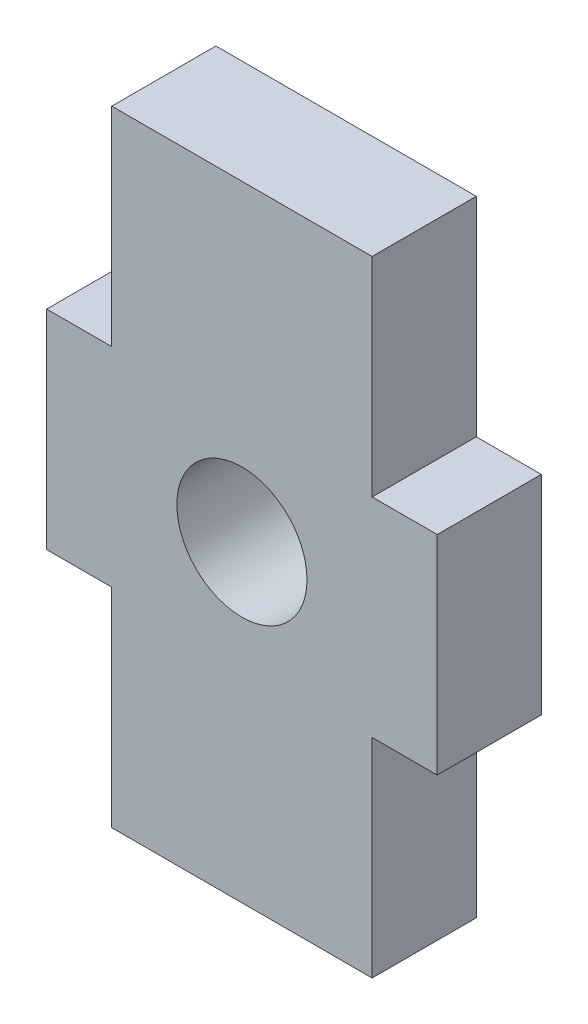
ISO-10303-21;
HEADER;
FILE_DESCRIPTION(('STEP AP214'),'2;1');
FILE_NAME('part.step','',(''),(''),'','','');
FILE_SCHEMA(('AUTOMOTIVE_DESIGN { 1 0 10303 214 1 1 1 1 }'));
ENDSEC;
DATA;
#1=APPLICATION_CONTEXT('core data for automotive mechanical design processes');
#2=APPLICATION_PROTOCOL_DEFINITION('international standard','automotive_design',2000,#1);
#3=PRODUCT_CONTEXT('',#1,'mechanical');
#4=PRODUCT('Part','Part','',(#3));
#5=PRODUCT_RELATED_PRODUCT_CATEGORY('part','',(#4));
#6=PRODUCT_DEFINITION_FORMATION('','',#4);
#7=PRODUCT_DEFINITION_CONTEXT('part definition',#1,'design');
#8=PRODUCT_DEFINITION('design','',#6,#7);
#9=PRODUCT_DEFINITION_SHAPE('','',#8);
#10=(LENGTH_UNIT() NAMED_UNIT(*) SI_UNIT(.MILLI.,.METRE.));
#11=(NAMED_UNIT(*) PLANE_ANGLE_UNIT() SI_UNIT($,.RADIAN.));
#12=(NAMED_UNIT(*) SI_UNIT($,.STERADIAN.) SOLID_ANGLE_UNIT());
#13=UNCERTAINTY_MEASURE_WITH_UNIT(LENGTH_MEASURE(1.E-05),#10,'distance_accuracy_value','');
#14=(GEOMETRIC_REPRESENTATION_CONTEXT(3) GLOBAL_UNCERTAINTY_ASSIGNED_CONTEXT((#13)) GLOBAL_UNIT_ASSIGNED_CONTEXT((#10,
#11,#12)) REPRESENTATION_CONTEXT('',''));
#15=CARTESIAN_POINT('',(0.,0.,0.));
#16=DIRECTION('',(0.,0.,1.));
#17=DIRECTION('',(1.,0.,0.));
#18=AXIS2_PLACEMENT_3D('',#15,#16,#17);
#19=CARTESIAN_POINT('',(0.,0.,2.));
#20=DIRECTION('',(0.,0.,-1.));
#21=DIRECTION('',(-1.,0.,0.));
#22=AXIS2_PLACEMENT_3D('',#19,#20,#21);
#23=PLANE('',#22);
#24=DIRECTION('',(0.,1.,0.));
#25=VECTOR('',#24,1.);
#26=CARTESIAN_POINT('',(1957.17680872112,1462.88411595094,2.));
#27=LINE('',#26,#25);
#28=CARTESIAN_POINT('',(1957.17680872112,1462.88411595094,2.));
#29=VERTEX_POINT('',#28);
#30=CARTESIAN_POINT('',(1957.17680872112,1466.88411595094,2.));
#31=VERTEX_POINT('',#30);
#32=EDGE_CURVE('E177',#29,#31,#27,.T.);
#33=ORIENTED_EDGE('',*,*,#32,.T.);
#34=DIRECTION('',(-1.,0.,0.));
#35=VECTOR('',#34,1.);
#36=CARTESIAN_POINT('',(1952.17680872112,1466.88411595094,2.));
#37=LINE('',#36,#35);
#38=CARTESIAN_POINT('',(1952.17680872112,1466.88411595094,2.));
#39=VERTEX_POINT('',#38);
#40=EDGE_CURVE('E105',#31,#39,#37,.T.);
#41=ORIENTED_EDGE('',*,*,#40,.T.);
#42=DIRECTION('',(0.,-1.,0.));
#43=VECTOR('',#42,1.);
#44=CARTESIAN_POINT('',(1952.17680872112,1462.88411595094,2.));
#45=LINE('',#44,#43);
#46=CARTESIAN_POINT('',(1952.17680872112,1462.88411595094,2.));
#47=VERTEX_POINT('',#46);
#48=EDGE_CURVE('E204',#39,#47,#45,.T.);
#49=ORIENTED_EDGE('',*,*,#48,.T.);
#50=DIRECTION('',(-1.,0.,0.));
#51=VECTOR('',#50,1.);
#52=CARTESIAN_POINT('',(1952.17680872112,1462.88411595094,2.));
#53=LINE('',#52,#51);
#54=CARTESIAN_POINT('',(1950.92680872112,1462.88411595094,2.));
#55=VERTEX_POINT('',#54);
#56=EDGE_CURVE('E223',#47,#55,#53,.T.);
#57=ORIENTED_EDGE('',*,*,#56,.T.);
#58=DIRECTION('',(0.,-1.,0.));
#59=VECTOR('',#58,1.);
#60=CARTESIAN_POINT('',(1950.92680872112,1462.88411595094,2.));
#61=LINE('',#60,#59);
#62=CARTESIAN_POINT('',(1950.92680872112,1458.88411595094,2.));
#63=VERTEX_POINT('',#62);
#64=EDGE_CURVE('E220',#55,#63,#61,.T.);
#65=ORIENTED_EDGE('',*,*,#64,.T.);
#66=DIRECTION('',(1.,0.,0.));
#67=VECTOR('',#66,1.);
#68=CARTESIAN_POINT('',(1952.17680872112,1458.88411595094,2.));
#69=LINE('',#68,#67);
#70=CARTESIAN_POINT('',(1952.17680872112,1458.88411595094,2.));
#71=VERTEX_POINT('',#70);
#72=EDGE_CURVE('E222',#63,#71,#69,.T.);
#73=ORIENTED_EDGE('',*,*,#72,.T.);
#74=DIRECTION('',(-2.22044604925031E-13,-1.,0.));
#75=VECTOR('',#74,1.);
#76=CARTESIAN_POINT('',(1952.17680872112,1458.88411595094,2.));
#77=LINE('',#76,#75);
#78=CARTESIAN_POINT('',(1952.17680872112,1454.88411595094,2.));
#79=VERTEX_POINT('',#78);
#80=EDGE_CURVE('E225',#71,#79,#77,.T.);
#81=ORIENTED_EDGE('',*,*,#80,.T.);
#82=DIRECTION('',(1.,0.,0.));
#83=VECTOR('',#82,1.);
#84=CARTESIAN_POINT('',(1952.17680872112,1454.88411595094,2.));
#85=LINE('',#84,#83);
#86=CARTESIAN_POINT('',(1957.17680872112,1454.88411595094,2.));
#87=VERTEX_POINT('',#86);
#88=EDGE_CURVE('E231',#79,#87,#85,.T.);
#89=ORIENTED_EDGE('',*,*,#88,.T.);
#90=DIRECTION('',(0.,1.,0.));
#91=VECTOR('',#90,1.);
#92=CARTESIAN_POINT('',(1957.17680872112,1458.88411595094,2.));
#93=LINE('',#92,#91);
#94=CARTESIAN_POINT('',(1957.17680872112,1458.88411595094,2.));
#95=VERTEX_POINT('',#94);
#96=EDGE_CURVE('E136',#87,#95,#93,.T.);
#97=ORIENTED_EDGE('',*,*,#96,.T.);
#98=DIRECTION('',(1.,0.,0.));
#99=VECTOR('',#98,1.);
#100=CARTESIAN_POINT('',(1957.17680872112,1458.88411595094,2.));
#101=LINE('',#100,#99);
#102=CARTESIAN_POINT('',(1958.42680872112,1458.88411595094,2.));
#103=VERTEX_POINT('',#102);
#104=EDGE_CURVE('E130',#95,#103,#101,.T.);
#105=ORIENTED_EDGE('',*,*,#104,.T.);
#106=DIRECTION('',(1.11022302462522E-13,1.,0.));
#107=VECTOR('',#106,1.);
#108=CARTESIAN_POINT('',(1958.42680872112,1462.88411595094,2.));
#109=LINE('',#108,#107);
#110=CARTESIAN_POINT('',(1958.42680872112,1462.88411595094,2.));
#111=VERTEX_POINT('',#110);
#112=EDGE_CURVE('E134',#103,#111,#109,.T.);
#113=ORIENTED_EDGE('',*,*,#112,.T.);
#114=DIRECTION('',(-1.,0.,0.));
#115=VECTOR('',#114,1.);
#116=CARTESIAN_POINT('',(1957.17680872112,1462.88411595094,2.));
#117=LINE('',#116,#115);
#118=EDGE_CURVE('E50',#111,#29,#117,.T.);
#119=ORIENTED_EDGE('',*,*,#118,.T.);
#120=EDGE_LOOP('',(#33,#41,#49,#57,#65,#73,#81,#89,#97,#105,#113,#119));
#121=FACE_BOUND('',#120,.T.);
#122=CARTESIAN_POINT('',(1954.67680872112,1460.88411595095,2.));
#123=DIRECTION('',(0.,0.,1.));
#124=DIRECTION('',(1.,0.,0.));
#125=AXIS2_PLACEMENT_3D('',#122,#123,#124);
#126=CIRCLE('',#125,1.24999999999997);
#127=CARTESIAN_POINT('',(1955.92680872112,1460.88411595095,2.));
#128=VERTEX_POINT('',#127);
#129=EDGE_CURVE('E158',#128,#128,#126,.T.);
#130=ORIENTED_EDGE('',*,*,#129,.F.);
#131=EDGE_LOOP('',(#130));
#132=FACE_BOUND('',#131,.T.);
#133=ADVANCED_FACE('F33',(#121,#132),#23,.F.);
#134=CARTESIAN_POINT('',(0.,0.,0.));
#135=DIRECTION('',(0.,0.,-1.));
#136=DIRECTION('',(-1.,0.,0.));
#137=AXIS2_PLACEMENT_3D('',#134,#135,#136);
#138=PLANE('',#137);
#139=DIRECTION('',(0.,1.,0.));
#140=VECTOR('',#139,1.);
#141=CARTESIAN_POINT('',(1957.17680872112,1462.88411595094,0.));
#142=LINE('',#141,#140);
#143=CARTESIAN_POINT('',(1957.17680872112,1462.88411595094,0.));
#144=VERTEX_POINT('',#143);
#145=CARTESIAN_POINT('',(1957.17680872112,1466.88411595094,0.));
#146=VERTEX_POINT('',#145);
#147=EDGE_CURVE('E154',#144,#146,#142,.T.);
#148=ORIENTED_EDGE('',*,*,#147,.F.);
#149=DIRECTION('',(-1.,0.,0.));
#150=VECTOR('',#149,1.);
#151=CARTESIAN_POINT('',(1957.17680872112,1462.88411595094,0.));
#152=LINE('',#151,#150);
#153=CARTESIAN_POINT('',(1958.42680872112,1462.88411595094,0.));
#154=VERTEX_POINT('',#153);
#155=EDGE_CURVE('E97',#154,#144,#152,.T.);
#156=ORIENTED_EDGE('',*,*,#155,.F.);
#157=DIRECTION('',(1.11022302462522E-13,1.,0.));
#158=VECTOR('',#157,1.);
#159=CARTESIAN_POINT('',(1958.42680872112,1462.88411595094,0.));
#160=LINE('',#159,#158);
#161=CARTESIAN_POINT('',(1958.42680872112,1458.88411595094,0.));
#162=VERTEX_POINT('',#161);
#163=EDGE_CURVE('E91',#162,#154,#160,.T.);
#164=ORIENTED_EDGE('',*,*,#163,.F.);
#165=DIRECTION('',(1.,0.,0.));
#166=VECTOR('',#165,1.);
#167=CARTESIAN_POINT('',(1957.17680872112,1458.88411595094,0.));
#168=LINE('',#167,#166);
#169=CARTESIAN_POINT('',(1957.17680872112,1458.88411595094,0.));
#170=VERTEX_POINT('',#169);
#171=EDGE_CURVE('E144',#170,#162,#168,.T.);
#172=ORIENTED_EDGE('',*,*,#171,.F.);
#173=DIRECTION('',(0.,1.,0.));
#174=VECTOR('',#173,1.);
#175=CARTESIAN_POINT('',(1957.17680872112,1458.88411595094,0.));
#176=LINE('',#175,#174);
#177=CARTESIAN_POINT('',(1957.17680872112,1454.88411595094,0.));
#178=VERTEX_POINT('',#177);
#179=EDGE_CURVE('E172',#178,#170,#176,.T.);
#180=ORIENTED_EDGE('',*,*,#179,.F.);
#181=DIRECTION('',(1.,0.,0.));
#182=VECTOR('',#181,1.);
#183=CARTESIAN_POINT('',(1952.17680872112,1454.88411595094,0.));
#184=LINE('',#183,#182);
#185=CARTESIAN_POINT('',(1952.17680872112,1454.88411595094,0.));
#186=VERTEX_POINT('',#185);
#187=EDGE_CURVE('E170',#186,#178,#184,.T.);
#188=ORIENTED_EDGE('',*,*,#187,.F.);
#189=DIRECTION('',(-2.22044604925031E-13,-1.,0.));
#190=VECTOR('',#189,1.);
#191=CARTESIAN_POINT('',(1952.17680872112,1458.88411595094,0.));
#192=LINE('',#191,#190);
#193=CARTESIAN_POINT('',(1952.17680872112,1458.88411595094,0.));
#194=VERTEX_POINT('',#193);
#195=EDGE_CURVE('E168',#194,#186,#192,.T.);
#196=ORIENTED_EDGE('',*,*,#195,.F.);
#197=DIRECTION('',(1.,0.,0.));
#198=VECTOR('',#197,1.);
#199=CARTESIAN_POINT('',(1952.17680872112,1458.88411595094,0.));
#200=LINE('',#199,#198);
#201=CARTESIAN_POINT('',(1950.92680872112,1458.88411595094,0.));
#202=VERTEX_POINT('',#201);
#203=EDGE_CURVE('E166',#202,#194,#200,.T.);
#204=ORIENTED_EDGE('',*,*,#203,.F.);
#205=DIRECTION('',(0.,-1.,0.));
#206=VECTOR('',#205,1.);
#207=CARTESIAN_POINT('',(1950.92680872112,1462.88411595094,0.));
#208=LINE('',#207,#206);
#209=CARTESIAN_POINT('',(1950.92680872112,1462.88411595094,0.));
#210=VERTEX_POINT('',#209);
#211=EDGE_CURVE('E164',#210,#202,#208,.T.);
#212=ORIENTED_EDGE('',*,*,#211,.F.);
#213=DIRECTION('',(-1.,0.,0.));
#214=VECTOR('',#213,1.);
#215=CARTESIAN_POINT('',(1952.17680872112,1462.88411595094,0.));
#216=LINE('',#215,#214);
#217=CARTESIAN_POINT('',(1952.17680872112,1462.88411595094,0.));
#218=VERTEX_POINT('',#217);
#219=EDGE_CURVE('E162',#218,#210,#216,.T.);
#220=ORIENTED_EDGE('',*,*,#219,.F.);
#221=DIRECTION('',(0.,-1.,0.));
#222=VECTOR('',#221,1.);
#223=CARTESIAN_POINT('',(1952.17680872112,1462.88411595094,0.));
#224=LINE('',#223,#222);
#225=CARTESIAN_POINT('',(1952.17680872112,1466.88411595094,0.));
#226=VERTEX_POINT('',#225);
#227=EDGE_CURVE('E160',#226,#218,#224,.T.);
#228=ORIENTED_EDGE('',*,*,#227,.F.);
#229=DIRECTION('',(-1.,0.,0.));
#230=VECTOR('',#229,1.);
#231=CARTESIAN_POINT('',(1952.17680872112,1466.88411595094,0.));
#232=LINE('',#231,#230);
#233=EDGE_CURVE('E157',#146,#226,#232,.T.);
#234=ORIENTED_EDGE('',*,*,#233,.F.);
#235=EDGE_LOOP('',(#148,#156,#164,#172,#180,#188,#196,#204,#212,#220,#228,#234));
#236=FACE_BOUND('',#235,.T.);
#237=CARTESIAN_POINT('',(1954.67680872112,1460.88411595095,0.));
#238=DIRECTION('',(0.,0.,1.));
#239=DIRECTION('',(1.,0.,0.));
#240=AXIS2_PLACEMENT_3D('',#237,#238,#239);
#241=CIRCLE('',#240,1.24999999999997);
#242=CARTESIAN_POINT('',(1955.92680872112,1460.88411595095,0.));
#243=VERTEX_POINT('',#242);
#244=EDGE_CURVE('E378',#243,#243,#241,.T.);
#245=ORIENTED_EDGE('',*,*,#244,.T.);
#246=EDGE_LOOP('',(#245));
#247=FACE_BOUND('',#246,.T.);
#248=ADVANCED_FACE('F208',(#236,#247),#138,.T.);
#249=CARTESIAN_POINT('',(1957.17680872112,1462.88411595094,2.));
#250=DIRECTION('',(-1.,0.,0.));
#251=DIRECTION('',(0.,0.,1.));
#252=AXIS2_PLACEMENT_3D('',#249,#250,#251);
#253=PLANE('',#252);
#254=ORIENTED_EDGE('',*,*,#147,.T.);
#255=DIRECTION('',(0.,0.,-1.));
#256=VECTOR('',#255,1.);
#257=CARTESIAN_POINT('',(1957.17680872112,1466.88411595094,2.));
#258=LINE('',#257,#256);
#259=EDGE_CURVE('E11',#31,#146,#258,.T.);
#260=ORIENTED_EDGE('',*,*,#259,.F.);
#261=ORIENTED_EDGE('',*,*,#32,.F.);
#262=DIRECTION('',(0.,0.,-1.));
#263=VECTOR('',#262,1.);
#264=CARTESIAN_POINT('',(1957.17680872112,1462.88411595094,2.));
#265=LINE('',#264,#263);
#266=EDGE_CURVE('E150',#29,#144,#265,.T.);
#267=ORIENTED_EDGE('',*,*,#266,.T.);
#268=EDGE_LOOP('',(#254,#260,#261,#267));
#269=FACE_BOUND('',#268,.T.);
#270=ADVANCED_FACE('F35',(#269),#253,.F.);
#271=CARTESIAN_POINT('',(1952.17680872112,1466.88411595094,2.));
#272=DIRECTION('',(0.,-1.,0.));
#273=DIRECTION('',(0.,0.,-1.));
#274=AXIS2_PLACEMENT_3D('',#271,#272,#273);
#275=PLANE('',#274);
#276=ORIENTED_EDGE('',*,*,#233,.T.);
#277=DIRECTION('',(0.,0.,-1.));
#278=VECTOR('',#277,1.);
#279=CARTESIAN_POINT('',(1952.17680872112,1466.88411595094,2.));
#280=LINE('',#279,#278);
#281=EDGE_CURVE('E42',#39,#226,#280,.T.);
#282=ORIENTED_EDGE('',*,*,#281,.F.);
#283=ORIENTED_EDGE('',*,*,#40,.F.);
#284=ORIENTED_EDGE('',*,*,#259,.T.);
#285=EDGE_LOOP('',(#276,#282,#283,#284));
#286=FACE_BOUND('',#285,.T.);
#287=ADVANCED_FACE('F265',(#286),#275,.F.);
#288=CARTESIAN_POINT('',(1952.17680872112,1462.88411595094,2.));
#289=DIRECTION('',(1.,0.,0.));
#290=DIRECTION('',(0.,0.,-1.));
#291=AXIS2_PLACEMENT_3D('',#288,#289,#290);
#292=PLANE('',#291);
#293=ORIENTED_EDGE('',*,*,#227,.T.);
#294=DIRECTION('',(0.,0.,-1.));
#295=VECTOR('',#294,1.);
#296=CARTESIAN_POINT('',(1952.17680872112,1462.88411595094,2.));
#297=LINE('',#296,#295);
#298=EDGE_CURVE('E196',#47,#218,#297,.T.);
#299=ORIENTED_EDGE('',*,*,#298,.F.);
#300=ORIENTED_EDGE('',*,*,#48,.F.);
#301=ORIENTED_EDGE('',*,*,#281,.T.);
#302=EDGE_LOOP('',(#293,#299,#300,#301));
#303=FACE_BOUND('',#302,.T.);
#304=ADVANCED_FACE('F202',(#303),#292,.F.);
#305=CARTESIAN_POINT('',(1952.17680872112,1462.88411595094,2.));
#306=DIRECTION('',(0.,-1.,0.));
#307=DIRECTION('',(0.,0.,-1.));
#308=AXIS2_PLACEMENT_3D('',#305,#306,#307);
#309=PLANE('',#308);
#310=ORIENTED_EDGE('',*,*,#219,.T.);
#311=DIRECTION('',(0.,0.,-1.));
#312=VECTOR('',#311,1.);
#313=CARTESIAN_POINT('',(1950.92680872112,1462.88411595094,2.));
#314=LINE('',#313,#312);
#315=EDGE_CURVE('E193',#55,#210,#314,.T.);
#316=ORIENTED_EDGE('',*,*,#315,.F.);
#317=ORIENTED_EDGE('',*,*,#56,.F.);
#318=ORIENTED_EDGE('',*,*,#298,.T.);
#319=EDGE_LOOP('',(#310,#316,#317,#318));
#320=FACE_BOUND('',#319,.T.);
#321=ADVANCED_FACE('F214',(#320),#309,.F.);
#322=CARTESIAN_POINT('',(1950.92680872112,1462.88411595094,2.));
#323=DIRECTION('',(1.,0.,0.));
#324=DIRECTION('',(0.,0.,-1.));
#325=AXIS2_PLACEMENT_3D('',#322,#323,#324);
#326=PLANE('',#325);
#327=ORIENTED_EDGE('',*,*,#211,.T.);
#328=DIRECTION('',(0.,0.,-1.));
#329=VECTOR('',#328,1.);
#330=CARTESIAN_POINT('',(1950.92680872112,1458.88411595094,2.));
#331=LINE('',#330,#329);
#332=EDGE_CURVE('E190',#63,#202,#331,.T.);
#333=ORIENTED_EDGE('',*,*,#332,.F.);
#334=ORIENTED_EDGE('',*,*,#64,.F.);
#335=ORIENTED_EDGE('',*,*,#315,.T.);
#336=EDGE_LOOP('',(#327,#333,#334,#335));
#337=FACE_BOUND('',#336,.T.);
#338=ADVANCED_FACE('F218',(#337),#326,.F.);
#339=CARTESIAN_POINT('',(1952.17680872112,1458.88411595094,2.));
#340=DIRECTION('',(0.,1.,0.));
#341=DIRECTION('',(0.,0.,1.));
#342=AXIS2_PLACEMENT_3D('',#339,#340,#341);
#343=PLANE('',#342);
#344=ORIENTED_EDGE('',*,*,#203,.T.);
#345=DIRECTION('',(0.,0.,-1.));
#346=VECTOR('',#345,1.);
#347=CARTESIAN_POINT('',(1952.17680872112,1458.88411595094,2.));
#348=LINE('',#347,#346);
#349=EDGE_CURVE('E187',#71,#194,#348,.T.);
#350=ORIENTED_EDGE('',*,*,#349,.F.);
#351=ORIENTED_EDGE('',*,*,#72,.F.);
#352=ORIENTED_EDGE('',*,*,#332,.T.);
#353=EDGE_LOOP('',(#344,#350,#351,#352));
#354=FACE_BOUND('',#353,.T.);
#355=ADVANCED_FACE('F278',(#354),#343,.F.);
#356=CARTESIAN_POINT('',(1952.17680872112,1458.88411595094,2.));
#357=DIRECTION('',(1.,-2.22044604925031E-13,0.));
#358=DIRECTION('',(2.22044604925031E-13,1.,0.));
#359=AXIS2_PLACEMENT_3D('',#356,#357,#358);
#360=PLANE('',#359);
#361=ORIENTED_EDGE('',*,*,#195,.T.);
#362=DIRECTION('',(0.,0.,-1.));
#363=VECTOR('',#362,1.);
#364=CARTESIAN_POINT('',(1952.17680872112,1454.88411595094,2.));
#365=LINE('',#364,#363);
#366=EDGE_CURVE('E184',#79,#186,#365,.T.);
#367=ORIENTED_EDGE('',*,*,#366,.F.);
#368=ORIENTED_EDGE('',*,*,#80,.F.);
#369=ORIENTED_EDGE('',*,*,#349,.T.);
#370=EDGE_LOOP('',(#361,#367,#368,#369));
#371=FACE_BOUND('',#370,.T.);
#372=ADVANCED_FACE('F281',(#371),#360,.F.);
#373=CARTESIAN_POINT('',(1952.17680872112,1454.88411595094,2.));
#374=DIRECTION('',(0.,1.,0.));
#375=DIRECTION('',(0.,0.,1.));
#376=AXIS2_PLACEMENT_3D('',#373,#374,#375);
#377=PLANE('',#376);
#378=ORIENTED_EDGE('',*,*,#187,.T.);
#379=DIRECTION('',(0.,0.,-1.));
#380=VECTOR('',#379,1.);
#381=CARTESIAN_POINT('',(1957.17680872112,1454.88411595094,2.));
#382=LINE('',#381,#380);
#383=EDGE_CURVE('E181',#87,#178,#382,.T.);
#384=ORIENTED_EDGE('',*,*,#383,.F.);
#385=ORIENTED_EDGE('',*,*,#88,.F.);
#386=ORIENTED_EDGE('',*,*,#366,.T.);
#387=EDGE_LOOP('',(#378,#384,#385,#386));
#388=FACE_BOUND('',#387,.T.);
#389=ADVANCED_FACE('F237',(#388),#377,.F.);
#390=CARTESIAN_POINT('',(1957.17680872112,1458.88411595094,2.));
#391=DIRECTION('',(-1.,0.,0.));
#392=DIRECTION('',(0.,0.,1.));
#393=AXIS2_PLACEMENT_3D('',#390,#391,#392);
#394=PLANE('',#393);
#395=ORIENTED_EDGE('',*,*,#179,.T.);
#396=DIRECTION('',(0.,0.,-1.));
#397=VECTOR('',#396,1.);
#398=CARTESIAN_POINT('',(1957.17680872112,1458.88411595094,2.));
#399=LINE('',#398,#397);
#400=EDGE_CURVE('E145',#95,#170,#399,.T.);
#401=ORIENTED_EDGE('',*,*,#400,.F.);
#402=ORIENTED_EDGE('',*,*,#96,.F.);
#403=ORIENTED_EDGE('',*,*,#383,.T.);
#404=EDGE_LOOP('',(#395,#401,#402,#403));
#405=FACE_BOUND('',#404,.T.);
#406=ADVANCED_FACE('F241',(#405),#394,.F.);
#407=CARTESIAN_POINT('',(1957.17680872112,1458.88411595094,2.));
#408=DIRECTION('',(0.,1.,0.));
#409=DIRECTION('',(0.,0.,1.));
#410=AXIS2_PLACEMENT_3D('',#407,#408,#409);
#411=PLANE('',#410);
#412=ORIENTED_EDGE('',*,*,#171,.T.);
#413=DIRECTION('',(0.,0.,-1.));
#414=VECTOR('',#413,1.);
#415=CARTESIAN_POINT('',(1958.42680872112,1458.88411595094,2.));
#416=LINE('',#415,#414);
#417=EDGE_CURVE('E141',#103,#162,#416,.T.);
#418=ORIENTED_EDGE('',*,*,#417,.F.);
#419=ORIENTED_EDGE('',*,*,#104,.F.);
#420=ORIENTED_EDGE('',*,*,#400,.T.);
#421=EDGE_LOOP('',(#412,#418,#419,#420));
#422=FACE_BOUND('',#421,.T.);
#423=ADVANCED_FACE('F142',(#422),#411,.F.);
#424=CARTESIAN_POINT('',(1958.42680872112,1462.88411595094,2.));
#425=DIRECTION('',(-1.,1.11022302462522E-13,0.));
#426=DIRECTION('',(-1.11022302462522E-13,-1.,0.));
#427=AXIS2_PLACEMENT_3D('',#424,#425,#426);
#428=PLANE('',#427);
#429=ORIENTED_EDGE('',*,*,#163,.T.);
#430=DIRECTION('',(0.,0.,-1.));
#431=VECTOR('',#430,1.);
#432=CARTESIAN_POINT('',(1958.42680872112,1462.88411595094,2.));
#433=LINE('',#432,#431);
#434=EDGE_CURVE('E146',#111,#154,#433,.T.);
#435=ORIENTED_EDGE('',*,*,#434,.F.);
#436=ORIENTED_EDGE('',*,*,#112,.F.);
#437=ORIENTED_EDGE('',*,*,#417,.T.);
#438=EDGE_LOOP('',(#429,#435,#436,#437));
#439=FACE_BOUND('',#438,.T.);
#440=ADVANCED_FACE('F148',(#439),#428,.F.);
#441=CARTESIAN_POINT('',(1957.17680872112,1462.88411595094,2.));
#442=DIRECTION('',(0.,-1.,0.));
#443=DIRECTION('',(0.,0.,-1.));
#444=AXIS2_PLACEMENT_3D('',#441,#442,#443);
#445=PLANE('',#444);
#446=ORIENTED_EDGE('',*,*,#155,.T.);
#447=ORIENTED_EDGE('',*,*,#266,.F.);
#448=ORIENTED_EDGE('',*,*,#118,.F.);
#449=ORIENTED_EDGE('',*,*,#434,.T.);
#450=EDGE_LOOP('',(#446,#447,#448,#449));
#451=FACE_BOUND('',#450,.T.);
#452=ADVANCED_FACE('F245',(#451),#445,.F.);
#453=CARTESIAN_POINT('',(1954.67680872112,1460.88411595095,2.));
#454=DIRECTION('',(0.,0.,-1.));
#455=DIRECTION('',(-1.,0.,0.));
#456=AXIS2_PLACEMENT_3D('',#453,#454,#455);
#457=CYLINDRICAL_SURFACE('',#456,1.24999999999997);
#458=ORIENTED_EDGE('',*,*,#129,.T.);
#459=EDGE_LOOP('',(#458));
#460=FACE_BOUND('',#459,.T.);
#461=ORIENTED_EDGE('',*,*,#244,.F.);
#462=EDGE_LOOP('',(#461));
#463=FACE_BOUND('',#462,.T.);
#464=ADVANCED_FACE('F247',(#460,#463),#457,.F.);
#465=CLOSED_SHELL('',(#133,#248,#270,#287,#304,#321,#338,#355,#372,#389,#406,#423,#440,#452,#464));
#466=MANIFOLD_SOLID_BREP('B2',#465);
#467=ADVANCED_BREP_SHAPE_REPRESENTATION('',(#18,#466),#14);
#468=SHAPE_DEFINITION_REPRESENTATION(#9,#467);
ENDSEC;
END-ISO-10303-21;
